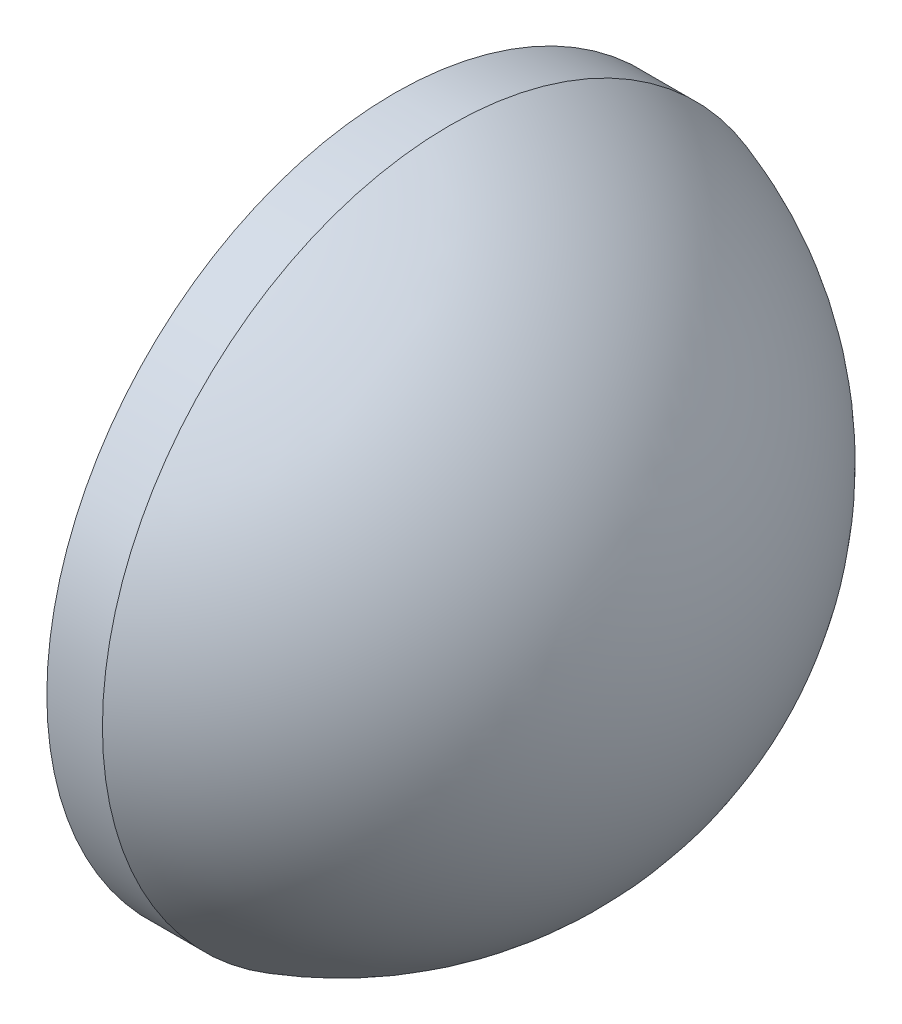
ISO-10303-21;
HEADER;
FILE_DESCRIPTION(('STEP AP214'),'2;1');
FILE_NAME('part.step','',(''),(''),'','','');
FILE_SCHEMA(('AUTOMOTIVE_DESIGN { 1 0 10303 214 1 1 1 1 }'));
ENDSEC;
DATA;
#1=APPLICATION_CONTEXT('core data for automotive mechanical design processes');
#2=APPLICATION_PROTOCOL_DEFINITION('international standard','automotive_design',2000,#1);
#3=PRODUCT_CONTEXT('',#1,'mechanical');
#4=PRODUCT('Part','Part','',(#3));
#5=PRODUCT_RELATED_PRODUCT_CATEGORY('part','',(#4));
#6=PRODUCT_DEFINITION_FORMATION('','',#4);
#7=PRODUCT_DEFINITION_CONTEXT('part definition',#1,'design');
#8=PRODUCT_DEFINITION('design','',#6,#7);
#9=PRODUCT_DEFINITION_SHAPE('','',#8);
#10=(LENGTH_UNIT() NAMED_UNIT(*) SI_UNIT(.MILLI.,.METRE.));
#11=(NAMED_UNIT(*) PLANE_ANGLE_UNIT() SI_UNIT($,.RADIAN.));
#12=(NAMED_UNIT(*) SI_UNIT($,.STERADIAN.) SOLID_ANGLE_UNIT());
#13=UNCERTAINTY_MEASURE_WITH_UNIT(LENGTH_MEASURE(1.E-05),#10,'distance_accuracy_value','');
#14=(GEOMETRIC_REPRESENTATION_CONTEXT(3) GLOBAL_UNCERTAINTY_ASSIGNED_CONTEXT((#13)) GLOBAL_UNIT_ASSIGNED_CONTEXT((#10,
#11,#12)) REPRESENTATION_CONTEXT('',''));
#15=CARTESIAN_POINT('',(0.,0.,0.));
#16=DIRECTION('',(0.,0.,1.));
#17=DIRECTION('',(1.,0.,0.));
#18=AXIS2_PLACEMENT_3D('',#15,#16,#17);
#19=CARTESIAN_POINT('',(417.978956488396,66.5779851039746,0.));
#20=DIRECTION('',(-1.,0.,0.));
#21=DIRECTION('',(0.,-1.,0.));
#22=AXIS2_PLACEMENT_3D('',#19,#20,#21);
#23=SPHERICAL_SURFACE('',#22,13.1089301310043);
#24=CARTESIAN_POINT('',(421.9278866194,66.5779851039746,0.));
#25=DIRECTION('',(-1.,0.,0.));
#26=DIRECTION('',(0.,0.,1.));
#27=AXIS2_PLACEMENT_3D('',#24,#25,#26);
#28=CIRCLE('',#27,12.5);
#29=CARTESIAN_POINT('',(421.9278866194,66.5779851039746,12.5));
#30=VERTEX_POINT('',#29);
#31=EDGE_CURVE('E10',#30,#30,#28,.T.);
#32=ORIENTED_EDGE('',*,*,#31,.F.);
#33=EDGE_LOOP('',(#32));
#34=FACE_BOUND('',#33,.T.);
#35=ADVANCED_FACE('F35',(#34),#23,.T.);
#36=CARTESIAN_POINT('',(417.422937599827,66.5779851039746,0.));
#37=DIRECTION('',(-1.,0.,0.));
#38=DIRECTION('',(0.,0.,1.));
#39=AXIS2_PLACEMENT_3D('',#36,#37,#38);
#40=CYLINDRICAL_SURFACE('',#39,12.5);
#41=CARTESIAN_POINT('',(419.9278866194,66.5779851039746,0.));
#42=DIRECTION('',(-1.,0.,0.));
#43=DIRECTION('',(0.,0.,1.));
#44=AXIS2_PLACEMENT_3D('',#41,#42,#43);
#45=CIRCLE('',#44,12.5);
#46=CARTESIAN_POINT('',(419.9278866194,66.5779851039746,12.5));
#47=VERTEX_POINT('',#46);
#48=EDGE_CURVE('E41',#47,#47,#45,.T.);
#49=ORIENTED_EDGE('',*,*,#48,.F.);
#50=EDGE_LOOP('',(#49));
#51=FACE_BOUND('',#50,.T.);
#52=ORIENTED_EDGE('',*,*,#31,.T.);
#53=EDGE_LOOP('',(#52));
#54=FACE_BOUND('',#53,.T.);
#55=ADVANCED_FACE('F49',(#51,#54),#40,.T.);
#56=CARTESIAN_POINT('',(419.9278866194,66.5779851039746,0.));
#57=DIRECTION('',(1.,0.,0.));
#58=DIRECTION('',(0.,0.,-1.));
#59=AXIS2_PLACEMENT_3D('',#56,#57,#58);
#60=PLANE('',#59);
#61=ORIENTED_EDGE('',*,*,#48,.T.);
#62=EDGE_LOOP('',(#61));
#63=FACE_BOUND('',#62,.T.);
#64=ADVANCED_FACE('F47',(#63),#60,.F.);
#65=CLOSED_SHELL('',(#35,#55,#64));
#66=MANIFOLD_SOLID_BREP('B2',#65);
#67=ADVANCED_BREP_SHAPE_REPRESENTATION('',(#18,#66),#14);
#68=SHAPE_DEFINITION_REPRESENTATION(#9,#67);
ENDSEC;
END-ISO-10303-21;
